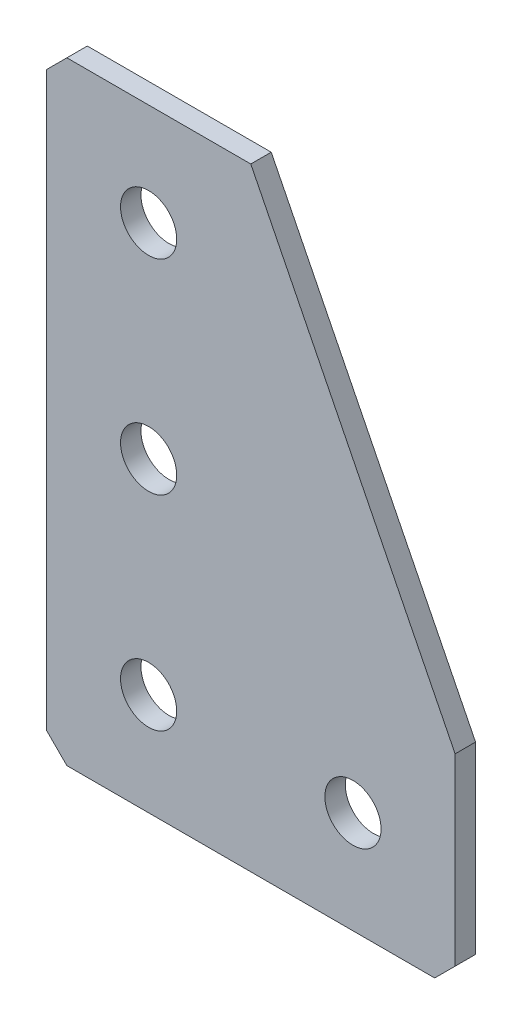
ISO-10303-21;
HEADER;
FILE_DESCRIPTION(('STEP AP214'),'2;1');
FILE_NAME('part.step','',(''),(''),'','','');
FILE_SCHEMA(('AUTOMOTIVE_DESIGN { 1 0 10303 214 1 1 1 1 }'));
ENDSEC;
DATA;
#1=APPLICATION_CONTEXT('core data for automotive mechanical design processes');
#2=APPLICATION_PROTOCOL_DEFINITION('international standard','automotive_design',2000,#1);
#3=PRODUCT_CONTEXT('',#1,'mechanical');
#4=PRODUCT('Part','Part','',(#3));
#5=PRODUCT_RELATED_PRODUCT_CATEGORY('part','',(#4));
#6=PRODUCT_DEFINITION_FORMATION('','',#4);
#7=PRODUCT_DEFINITION_CONTEXT('part definition',#1,'design');
#8=PRODUCT_DEFINITION('design','',#6,#7);
#9=PRODUCT_DEFINITION_SHAPE('','',#8);
#10=(LENGTH_UNIT() NAMED_UNIT(*) SI_UNIT(.MILLI.,.METRE.));
#11=(NAMED_UNIT(*) PLANE_ANGLE_UNIT() SI_UNIT($,.RADIAN.));
#12=(NAMED_UNIT(*) SI_UNIT($,.STERADIAN.) SOLID_ANGLE_UNIT());
#13=UNCERTAINTY_MEASURE_WITH_UNIT(LENGTH_MEASURE(1.E-05),#10,'distance_accuracy_value','');
#14=(GEOMETRIC_REPRESENTATION_CONTEXT(3) GLOBAL_UNCERTAINTY_ASSIGNED_CONTEXT((#13)) GLOBAL_UNIT_ASSIGNED_CONTEXT((#10,
#11,#12)) REPRESENTATION_CONTEXT('',''));
#15=CARTESIAN_POINT('',(0.,0.,0.));
#16=DIRECTION('',(0.,0.,1.));
#17=DIRECTION('',(1.,0.,0.));
#18=AXIS2_PLACEMENT_3D('',#15,#16,#17);
#19=CARTESIAN_POINT('',(20.,0.,-2.));
#20=DIRECTION('',(0.,-1.,0.));
#21=DIRECTION('',(1.,0.,0.));
#22=AXIS2_PLACEMENT_3D('',#19,#20,#21);
#23=PLANE('',#22);
#24=DIRECTION('',(1.,0.,0.));
#25=VECTOR('',#24,1.);
#26=CARTESIAN_POINT('',(20.,0.,-2.));
#27=LINE('',#26,#25);
#28=CARTESIAN_POINT('',(2.00000000000001,0.,-2.));
#29=VERTEX_POINT('',#28);
#30=CARTESIAN_POINT('',(20.,0.,-2.));
#31=VERTEX_POINT('',#30);
#32=EDGE_CURVE('E106',#29,#31,#27,.T.);
#33=ORIENTED_EDGE('',*,*,#32,.F.);
#34=DIRECTION('',(0.,0.,1.));
#35=VECTOR('',#34,1.);
#36=CARTESIAN_POINT('',(2.00000000000001,0.,-2.));
#37=LINE('',#36,#35);
#38=CARTESIAN_POINT('',(2.00000000000001,0.,0.));
#39=VERTEX_POINT('',#38);
#40=EDGE_CURVE('E135',#29,#39,#37,.T.);
#41=ORIENTED_EDGE('',*,*,#40,.T.);
#42=DIRECTION('',(1.,0.,0.));
#43=VECTOR('',#42,1.);
#44=CARTESIAN_POINT('',(20.,0.,0.));
#45=LINE('',#44,#43);
#46=CARTESIAN_POINT('',(20.,0.,0.));
#47=VERTEX_POINT('',#46);
#48=EDGE_CURVE('E132',#39,#47,#45,.T.);
#49=ORIENTED_EDGE('',*,*,#48,.T.);
#50=DIRECTION('',(0.,0.,1.));
#51=VECTOR('',#50,1.);
#52=CARTESIAN_POINT('',(20.,0.,-2.));
#53=LINE('',#52,#51);
#54=EDGE_CURVE('E124',#31,#47,#53,.T.);
#55=ORIENTED_EDGE('',*,*,#54,.F.);
#56=EDGE_LOOP('',(#33,#41,#49,#55));
#57=FACE_BOUND('',#56,.T.);
#58=ADVANCED_FACE('F41',(#57),#23,.F.);
#59=CARTESIAN_POINT('',(40.,-40.,-2.));
#60=DIRECTION('',(-0.894427190999916,-0.447213595499958,0.));
#61=DIRECTION('',(0.447213595499958,-0.894427190999916,0.));
#62=AXIS2_PLACEMENT_3D('',#59,#60,#61);
#63=PLANE('',#62);
#64=DIRECTION('',(0.447213595499958,-0.894427190999916,0.));
#65=VECTOR('',#64,1.);
#66=CARTESIAN_POINT('',(40.,-40.,0.));
#67=LINE('',#66,#65);
#68=CARTESIAN_POINT('',(40.,-40.,0.));
#69=VERTEX_POINT('',#68);
#70=EDGE_CURVE('E190',#47,#69,#67,.T.);
#71=ORIENTED_EDGE('',*,*,#70,.T.);
#72=DIRECTION('',(0.,0.,1.));
#73=VECTOR('',#72,1.);
#74=CARTESIAN_POINT('',(40.,-40.,-2.));
#75=LINE('',#74,#73);
#76=CARTESIAN_POINT('',(40.,-40.,-2.));
#77=VERTEX_POINT('',#76);
#78=EDGE_CURVE('E126',#77,#69,#75,.T.);
#79=ORIENTED_EDGE('',*,*,#78,.F.);
#80=DIRECTION('',(0.447213595499958,-0.894427190999916,0.));
#81=VECTOR('',#80,1.);
#82=CARTESIAN_POINT('',(40.,-40.,-2.));
#83=LINE('',#82,#81);
#84=EDGE_CURVE('E110',#31,#77,#83,.T.);
#85=ORIENTED_EDGE('',*,*,#84,.F.);
#86=ORIENTED_EDGE('',*,*,#54,.T.);
#87=EDGE_LOOP('',(#71,#79,#85,#86));
#88=FACE_BOUND('',#87,.T.);
#89=ADVANCED_FACE('F123',(#88),#63,.F.);
#90=CARTESIAN_POINT('',(40.,-60.,-2.));
#91=DIRECTION('',(-1.,0.,0.));
#92=DIRECTION('',(0.,0.,1.));
#93=AXIS2_PLACEMENT_3D('',#90,#91,#92);
#94=PLANE('',#93);
#95=DIRECTION('',(0.,-1.,0.));
#96=VECTOR('',#95,1.);
#97=CARTESIAN_POINT('',(40.,-60.,0.));
#98=LINE('',#97,#96);
#99=CARTESIAN_POINT('',(40.,-58.,0.));
#100=VERTEX_POINT('',#99);
#101=EDGE_CURVE('E184',#69,#100,#98,.T.);
#102=ORIENTED_EDGE('',*,*,#101,.T.);
#103=DIRECTION('',(0.,0.,-1.));
#104=VECTOR('',#103,1.);
#105=CARTESIAN_POINT('',(40.,-58.,-2.));
#106=LINE('',#105,#104);
#107=CARTESIAN_POINT('',(40.,-58.,-2.));
#108=VERTEX_POINT('',#107);
#109=EDGE_CURVE('E11',#100,#108,#106,.T.);
#110=ORIENTED_EDGE('',*,*,#109,.T.);
#111=DIRECTION('',(0.,-1.,0.));
#112=VECTOR('',#111,1.);
#113=CARTESIAN_POINT('',(40.,-60.,-2.));
#114=LINE('',#113,#112);
#115=EDGE_CURVE('E129',#77,#108,#114,.T.);
#116=ORIENTED_EDGE('',*,*,#115,.F.);
#117=ORIENTED_EDGE('',*,*,#78,.T.);
#118=EDGE_LOOP('',(#102,#110,#116,#117));
#119=FACE_BOUND('',#118,.T.);
#120=ADVANCED_FACE('F269',(#119),#94,.F.);
#121=CARTESIAN_POINT('',(0.,-60.,-2.));
#122=DIRECTION('',(0.,1.,0.));
#123=DIRECTION('',(0.,0.,1.));
#124=AXIS2_PLACEMENT_3D('',#121,#122,#123);
#125=PLANE('',#124);
#126=DIRECTION('',(-1.,0.,0.));
#127=VECTOR('',#126,1.);
#128=CARTESIAN_POINT('',(0.,-60.,-2.));
#129=LINE('',#128,#127);
#130=CARTESIAN_POINT('',(38.,-60.,-2.));
#131=VERTEX_POINT('',#130);
#132=CARTESIAN_POINT('',(2.00000000000001,-60.,-2.));
#133=VERTEX_POINT('',#132);
#134=EDGE_CURVE('E176',#131,#133,#129,.T.);
#135=ORIENTED_EDGE('',*,*,#134,.F.);
#136=DIRECTION('',(0.,0.,1.));
#137=VECTOR('',#136,1.);
#138=CARTESIAN_POINT('',(38.,-60.,-2.));
#139=LINE('',#138,#137);
#140=CARTESIAN_POINT('',(38.,-60.,0.));
#141=VERTEX_POINT('',#140);
#142=EDGE_CURVE('E50',#131,#141,#139,.T.);
#143=ORIENTED_EDGE('',*,*,#142,.T.);
#144=DIRECTION('',(-1.,0.,0.));
#145=VECTOR('',#144,1.);
#146=CARTESIAN_POINT('',(0.,-60.,0.));
#147=LINE('',#146,#145);
#148=CARTESIAN_POINT('',(2.00000000000001,-60.,0.));
#149=VERTEX_POINT('',#148);
#150=EDGE_CURVE('E175',#141,#149,#147,.T.);
#151=ORIENTED_EDGE('',*,*,#150,.T.);
#152=DIRECTION('',(0.,0.,-1.));
#153=VECTOR('',#152,1.);
#154=CARTESIAN_POINT('',(2.00000000000001,-60.,-2.));
#155=LINE('',#154,#153);
#156=EDGE_CURVE('E57',#149,#133,#155,.T.);
#157=ORIENTED_EDGE('',*,*,#156,.T.);
#158=EDGE_LOOP('',(#135,#143,#151,#157));
#159=FACE_BOUND('',#158,.T.);
#160=ADVANCED_FACE('F174',(#159),#125,.F.);
#161=CARTESIAN_POINT('',(0.,0.,-2.));
#162=DIRECTION('',(1.,0.,0.));
#163=DIRECTION('',(0.,0.,-1.));
#164=AXIS2_PLACEMENT_3D('',#161,#162,#163);
#165=PLANE('',#164);
#166=DIRECTION('',(0.,1.,0.));
#167=VECTOR('',#166,1.);
#168=CARTESIAN_POINT('',(0.,0.,0.));
#169=LINE('',#168,#167);
#170=CARTESIAN_POINT('',(0.,-58.,0.));
#171=VERTEX_POINT('',#170);
#172=CARTESIAN_POINT('',(0.,-2.00000000000002,0.));
#173=VERTEX_POINT('',#172);
#174=EDGE_CURVE('E119',#171,#173,#169,.T.);
#175=ORIENTED_EDGE('',*,*,#174,.T.);
#176=DIRECTION('',(0.,0.,-1.));
#177=VECTOR('',#176,1.);
#178=CARTESIAN_POINT('',(0.,-2.00000000000002,-2.));
#179=LINE('',#178,#177);
#180=CARTESIAN_POINT('',(0.,-2.00000000000002,-2.));
#181=VERTEX_POINT('',#180);
#182=EDGE_CURVE('E158',#173,#181,#179,.T.);
#183=ORIENTED_EDGE('',*,*,#182,.T.);
#184=DIRECTION('',(0.,1.,0.));
#185=VECTOR('',#184,1.);
#186=CARTESIAN_POINT('',(0.,0.,-2.));
#187=LINE('',#186,#185);
#188=CARTESIAN_POINT('',(0.,-58.,-2.));
#189=VERTEX_POINT('',#188);
#190=EDGE_CURVE('E142',#189,#181,#187,.T.);
#191=ORIENTED_EDGE('',*,*,#190,.F.);
#192=DIRECTION('',(0.,0.,1.));
#193=VECTOR('',#192,1.);
#194=CARTESIAN_POINT('',(0.,-58.,-2.));
#195=LINE('',#194,#193);
#196=EDGE_CURVE('E154',#189,#171,#195,.T.);
#197=ORIENTED_EDGE('',*,*,#196,.T.);
#198=EDGE_LOOP('',(#175,#183,#191,#197));
#199=FACE_BOUND('',#198,.T.);
#200=ADVANCED_FACE('F241',(#199),#165,.F.);
#201=CARTESIAN_POINT('',(0.,0.,-2.));
#202=DIRECTION('',(0.,0.,1.));
#203=DIRECTION('',(1.,0.,0.));
#204=AXIS2_PLACEMENT_3D('',#201,#202,#203);
#205=PLANE('',#204);
#206=CARTESIAN_POINT('',(30.,-50.,-2.));
#207=DIRECTION('',(0.,0.,-1.));
#208=DIRECTION('',(0.,1.,0.));
#209=AXIS2_PLACEMENT_3D('',#206,#207,#208);
#210=CIRCLE('',#209,2.75);
#211=CARTESIAN_POINT('',(30.,-47.25,-2.));
#212=VERTEX_POINT('',#211);
#213=EDGE_CURVE('E231',#212,#212,#210,.T.);
#214=ORIENTED_EDGE('',*,*,#213,.F.);
#215=EDGE_LOOP('',(#214));
#216=FACE_BOUND('',#215,.T.);
#217=CARTESIAN_POINT('',(10.,-50.,-2.));
#218=DIRECTION('',(0.,0.,-1.));
#219=DIRECTION('',(0.,1.,0.));
#220=AXIS2_PLACEMENT_3D('',#217,#218,#219);
#221=CIRCLE('',#220,2.75);
#222=CARTESIAN_POINT('',(10.,-47.25,-2.));
#223=VERTEX_POINT('',#222);
#224=EDGE_CURVE('E223',#223,#223,#221,.T.);
#225=ORIENTED_EDGE('',*,*,#224,.F.);
#226=EDGE_LOOP('',(#225));
#227=FACE_BOUND('',#226,.T.);
#228=CARTESIAN_POINT('',(10.,-30.,-2.));
#229=DIRECTION('',(0.,0.,-1.));
#230=DIRECTION('',(0.,1.,0.));
#231=AXIS2_PLACEMENT_3D('',#228,#229,#230);
#232=CIRCLE('',#231,2.75);
#233=CARTESIAN_POINT('',(10.,-27.25,-2.));
#234=VERTEX_POINT('',#233);
#235=EDGE_CURVE('E215',#234,#234,#232,.T.);
#236=ORIENTED_EDGE('',*,*,#235,.F.);
#237=EDGE_LOOP('',(#236));
#238=FACE_BOUND('',#237,.T.);
#239=CARTESIAN_POINT('',(10.,-9.99999999999999,-2.));
#240=DIRECTION('',(0.,0.,-1.));
#241=DIRECTION('',(0.,1.,0.));
#242=AXIS2_PLACEMENT_3D('',#239,#240,#241);
#243=CIRCLE('',#242,2.75);
#244=CARTESIAN_POINT('',(10.,-7.24999999999999,-2.));
#245=VERTEX_POINT('',#244);
#246=EDGE_CURVE('E207',#245,#245,#243,.T.);
#247=ORIENTED_EDGE('',*,*,#246,.F.);
#248=EDGE_LOOP('',(#247));
#249=FACE_BOUND('',#248,.T.);
#250=ORIENTED_EDGE('',*,*,#190,.T.);
#251=DIRECTION('',(-0.707106781186546,-0.707106781186549,0.));
#252=VECTOR('',#251,1.);
#253=CARTESIAN_POINT('',(2.00000000000001,0.,-2.));
#254=LINE('',#253,#252);
#255=EDGE_CURVE('E113',#181,#29,#254,.F.);
#256=ORIENTED_EDGE('',*,*,#255,.T.);
#257=ORIENTED_EDGE('',*,*,#32,.T.);
#258=ORIENTED_EDGE('',*,*,#84,.T.);
#259=ORIENTED_EDGE('',*,*,#115,.T.);
#260=DIRECTION('',(0.707106781186545,0.70710678118655,0.));
#261=VECTOR('',#260,1.);
#262=CARTESIAN_POINT('',(38.,-60.,-2.));
#263=LINE('',#262,#261);
#264=EDGE_CURVE('E64',#108,#131,#263,.F.);
#265=ORIENTED_EDGE('',*,*,#264,.T.);
#266=ORIENTED_EDGE('',*,*,#134,.T.);
#267=DIRECTION('',(0.70710678118655,-0.707106781186545,0.));
#268=VECTOR('',#267,1.);
#269=CARTESIAN_POINT('',(0.,-58.,-2.));
#270=LINE('',#269,#268);
#271=EDGE_CURVE('E161',#133,#189,#270,.F.);
#272=ORIENTED_EDGE('',*,*,#271,.T.);
#273=EDGE_LOOP('',(#250,#256,#257,#258,#259,#265,#266,#272));
#274=FACE_BOUND('',#273,.T.);
#275=ADVANCED_FACE('F109',(#216,#227,#238,#249,#274),#205,.F.);
#276=CARTESIAN_POINT('',(0.,0.,0.));
#277=DIRECTION('',(0.,0.,1.));
#278=DIRECTION('',(1.,0.,0.));
#279=AXIS2_PLACEMENT_3D('',#276,#277,#278);
#280=PLANE('',#279);
#281=CARTESIAN_POINT('',(30.,-50.,0.));
#282=DIRECTION('',(0.,0.,-1.));
#283=DIRECTION('',(0.,1.,0.));
#284=AXIS2_PLACEMENT_3D('',#281,#282,#283);
#285=CIRCLE('',#284,2.75);
#286=CARTESIAN_POINT('',(30.,-47.25,0.));
#287=VERTEX_POINT('',#286);
#288=EDGE_CURVE('E227',#287,#287,#285,.T.);
#289=ORIENTED_EDGE('',*,*,#288,.T.);
#290=EDGE_LOOP('',(#289));
#291=FACE_BOUND('',#290,.T.);
#292=CARTESIAN_POINT('',(10.,-50.,0.));
#293=DIRECTION('',(0.,0.,-1.));
#294=DIRECTION('',(0.,1.,0.));
#295=AXIS2_PLACEMENT_3D('',#292,#293,#294);
#296=CIRCLE('',#295,2.75);
#297=CARTESIAN_POINT('',(10.,-47.25,0.));
#298=VERTEX_POINT('',#297);
#299=EDGE_CURVE('E219',#298,#298,#296,.T.);
#300=ORIENTED_EDGE('',*,*,#299,.T.);
#301=EDGE_LOOP('',(#300));
#302=FACE_BOUND('',#301,.T.);
#303=CARTESIAN_POINT('',(10.,-30.,0.));
#304=DIRECTION('',(0.,0.,-1.));
#305=DIRECTION('',(0.,1.,0.));
#306=AXIS2_PLACEMENT_3D('',#303,#304,#305);
#307=CIRCLE('',#306,2.75);
#308=CARTESIAN_POINT('',(10.,-27.25,0.));
#309=VERTEX_POINT('',#308);
#310=EDGE_CURVE('E211',#309,#309,#307,.T.);
#311=ORIENTED_EDGE('',*,*,#310,.T.);
#312=EDGE_LOOP('',(#311));
#313=FACE_BOUND('',#312,.T.);
#314=CARTESIAN_POINT('',(10.,-9.99999999999999,0.));
#315=DIRECTION('',(0.,0.,-1.));
#316=DIRECTION('',(0.,1.,0.));
#317=AXIS2_PLACEMENT_3D('',#314,#315,#316);
#318=CIRCLE('',#317,2.75);
#319=CARTESIAN_POINT('',(10.,-7.25,0.));
#320=VERTEX_POINT('',#319);
#321=EDGE_CURVE('E197',#320,#320,#318,.T.);
#322=ORIENTED_EDGE('',*,*,#321,.T.);
#323=EDGE_LOOP('',(#322));
#324=FACE_BOUND('',#323,.T.);
#325=ORIENTED_EDGE('',*,*,#48,.F.);
#326=DIRECTION('',(0.707106781186546,0.707106781186549,0.));
#327=VECTOR('',#326,1.);
#328=CARTESIAN_POINT('',(1.00000000000001,-1.,0.));
#329=LINE('',#328,#327);
#330=EDGE_CURVE('E151',#39,#173,#329,.F.);
#331=ORIENTED_EDGE('',*,*,#330,.T.);
#332=ORIENTED_EDGE('',*,*,#174,.F.);
#333=DIRECTION('',(-0.70710678118655,0.707106781186545,0.));
#334=VECTOR('',#333,1.);
#335=CARTESIAN_POINT('',(-29.,-29.0000000000002,0.));
#336=LINE('',#335,#334);
#337=EDGE_CURVE('E140',#171,#149,#336,.F.);
#338=ORIENTED_EDGE('',*,*,#337,.T.);
#339=ORIENTED_EDGE('',*,*,#150,.F.);
#340=DIRECTION('',(-0.707106781186545,-0.70710678118655,0.));
#341=VECTOR('',#340,1.);
#342=CARTESIAN_POINT('',(49.0000000000001,-48.9999999999998,0.));
#343=LINE('',#342,#341);
#344=EDGE_CURVE('E148',#141,#100,#343,.F.);
#345=ORIENTED_EDGE('',*,*,#344,.T.);
#346=ORIENTED_EDGE('',*,*,#101,.F.);
#347=ORIENTED_EDGE('',*,*,#70,.F.);
#348=EDGE_LOOP('',(#325,#331,#332,#338,#339,#345,#346,#347));
#349=FACE_BOUND('',#348,.T.);
#350=ADVANCED_FACE('F179',(#291,#302,#313,#324,#349),#280,.T.);
#351=CARTESIAN_POINT('',(10.,-9.99999999999999,-2.));
#352=DIRECTION('',(0.,0.,-1.));
#353=DIRECTION('',(0.,1.,0.));
#354=AXIS2_PLACEMENT_3D('',#351,#352,#353);
#355=CYLINDRICAL_SURFACE('',#354,2.75);
#356=ORIENTED_EDGE('',*,*,#321,.F.);
#357=EDGE_LOOP('',(#356));
#358=FACE_BOUND('',#357,.T.);
#359=ORIENTED_EDGE('',*,*,#246,.T.);
#360=EDGE_LOOP('',(#359));
#361=FACE_BOUND('',#360,.T.);
#362=ADVANCED_FACE('F249',(#358,#361),#355,.F.);
#363=CARTESIAN_POINT('',(10.,-30.,-2.));
#364=DIRECTION('',(0.,0.,-1.));
#365=DIRECTION('',(0.,1.,0.));
#366=AXIS2_PLACEMENT_3D('',#363,#364,#365);
#367=CYLINDRICAL_SURFACE('',#366,2.75);
#368=ORIENTED_EDGE('',*,*,#310,.F.);
#369=EDGE_LOOP('',(#368));
#370=FACE_BOUND('',#369,.T.);
#371=ORIENTED_EDGE('',*,*,#235,.T.);
#372=EDGE_LOOP('',(#371));
#373=FACE_BOUND('',#372,.T.);
#374=ADVANCED_FACE('F251',(#370,#373),#367,.F.);
#375=CARTESIAN_POINT('',(10.,-50.,-2.));
#376=DIRECTION('',(0.,0.,-1.));
#377=DIRECTION('',(0.,1.,0.));
#378=AXIS2_PLACEMENT_3D('',#375,#376,#377);
#379=CYLINDRICAL_SURFACE('',#378,2.75);
#380=ORIENTED_EDGE('',*,*,#299,.F.);
#381=EDGE_LOOP('',(#380));
#382=FACE_BOUND('',#381,.T.);
#383=ORIENTED_EDGE('',*,*,#224,.T.);
#384=EDGE_LOOP('',(#383));
#385=FACE_BOUND('',#384,.T.);
#386=ADVANCED_FACE('F258',(#382,#385),#379,.F.);
#387=CARTESIAN_POINT('',(30.,-50.,-2.));
#388=DIRECTION('',(0.,0.,-1.));
#389=DIRECTION('',(0.,1.,0.));
#390=AXIS2_PLACEMENT_3D('',#387,#388,#389);
#391=CYLINDRICAL_SURFACE('',#390,2.75);
#392=ORIENTED_EDGE('',*,*,#288,.F.);
#393=EDGE_LOOP('',(#392));
#394=FACE_BOUND('',#393,.T.);
#395=ORIENTED_EDGE('',*,*,#213,.T.);
#396=EDGE_LOOP('',(#395));
#397=FACE_BOUND('',#396,.T.);
#398=ADVANCED_FACE('F237',(#394,#397),#391,.F.);
#399=CARTESIAN_POINT('',(2.00000000000001,0.,-2.));
#400=DIRECTION('',(0.707106781186549,-0.707106781186546,0.));
#401=DIRECTION('',(0.,0.,1.));
#402=AXIS2_PLACEMENT_3D('',#399,#400,#401);
#403=PLANE('',#402);
#404=ORIENTED_EDGE('',*,*,#255,.F.);
#405=ORIENTED_EDGE('',*,*,#182,.F.);
#406=ORIENTED_EDGE('',*,*,#330,.F.);
#407=ORIENTED_EDGE('',*,*,#40,.F.);
#408=EDGE_LOOP('',(#404,#405,#406,#407));
#409=FACE_BOUND('',#408,.T.);
#410=ADVANCED_FACE('F273',(#409),#403,.F.);
#411=CARTESIAN_POINT('',(38.,-60.,-2.));
#412=DIRECTION('',(-0.70710678118655,0.707106781186545,0.));
#413=DIRECTION('',(0.,0.,1.));
#414=AXIS2_PLACEMENT_3D('',#411,#412,#413);
#415=PLANE('',#414);
#416=ORIENTED_EDGE('',*,*,#264,.F.);
#417=ORIENTED_EDGE('',*,*,#109,.F.);
#418=ORIENTED_EDGE('',*,*,#344,.F.);
#419=ORIENTED_EDGE('',*,*,#142,.F.);
#420=EDGE_LOOP('',(#416,#417,#418,#419));
#421=FACE_BOUND('',#420,.T.);
#422=ADVANCED_FACE('F275',(#421),#415,.F.);
#423=CARTESIAN_POINT('',(0.,-58.,-2.));
#424=DIRECTION('',(0.707106781186545,0.70710678118655,0.));
#425=DIRECTION('',(0.,0.,1.));
#426=AXIS2_PLACEMENT_3D('',#423,#424,#425);
#427=PLANE('',#426);
#428=ORIENTED_EDGE('',*,*,#271,.F.);
#429=ORIENTED_EDGE('',*,*,#156,.F.);
#430=ORIENTED_EDGE('',*,*,#337,.F.);
#431=ORIENTED_EDGE('',*,*,#196,.F.);
#432=EDGE_LOOP('',(#428,#429,#430,#431));
#433=FACE_BOUND('',#432,.T.);
#434=ADVANCED_FACE('F43',(#433),#427,.F.);
#435=CLOSED_SHELL('',(#58,#89,#120,#160,#200,#275,#350,#362,#374,#386,#398,#410,#422,#434));
#436=MANIFOLD_SOLID_BREP('B2',#435);
#437=ADVANCED_BREP_SHAPE_REPRESENTATION('',(#18,#436),#14);
#438=SHAPE_DEFINITION_REPRESENTATION(#9,#437);
ENDSEC;
END-ISO-10303-21;
